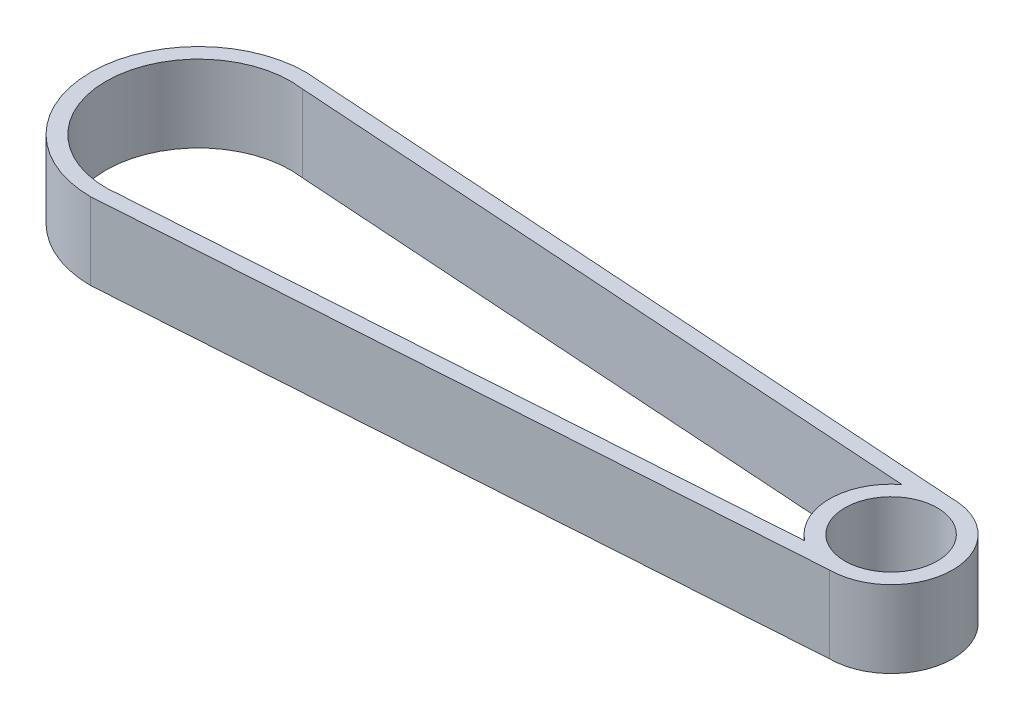
ISO-10303-21;
HEADER;
FILE_DESCRIPTION(('STEP AP214'),'2;1');
FILE_NAME('part.step','',(''),(''),'','','');
FILE_SCHEMA(('AUTOMOTIVE_DESIGN { 1 0 10303 214 1 1 1 1 }'));
ENDSEC;
DATA;
#1=APPLICATION_CONTEXT('core data for automotive mechanical design processes');
#2=APPLICATION_PROTOCOL_DEFINITION('international standard','automotive_design',2000,#1);
#3=PRODUCT_CONTEXT('',#1,'mechanical');
#4=PRODUCT('Part','Part','',(#3));
#5=PRODUCT_RELATED_PRODUCT_CATEGORY('part','',(#4));
#6=PRODUCT_DEFINITION_FORMATION('','',#4);
#7=PRODUCT_DEFINITION_CONTEXT('part definition',#1,'design');
#8=PRODUCT_DEFINITION('design','',#6,#7);
#9=PRODUCT_DEFINITION_SHAPE('','',#8);
#10=(LENGTH_UNIT() NAMED_UNIT(*) SI_UNIT(.MILLI.,.METRE.));
#11=(NAMED_UNIT(*) PLANE_ANGLE_UNIT() SI_UNIT($,.RADIAN.));
#12=(NAMED_UNIT(*) SI_UNIT($,.STERADIAN.) SOLID_ANGLE_UNIT());
#13=UNCERTAINTY_MEASURE_WITH_UNIT(LENGTH_MEASURE(1.E-05),#10,'distance_accuracy_value','');
#14=(GEOMETRIC_REPRESENTATION_CONTEXT(3) GLOBAL_UNCERTAINTY_ASSIGNED_CONTEXT((#13)) GLOBAL_UNIT_ASSIGNED_CONTEXT((#10,
#11,#12)) REPRESENTATION_CONTEXT('',''));
#15=CARTESIAN_POINT('',(0.,0.,0.));
#16=DIRECTION('',(0.,0.,1.));
#17=DIRECTION('',(1.,0.,0.));
#18=AXIS2_PLACEMENT_3D('',#15,#16,#17);
#19=CARTESIAN_POINT('',(0.,10.,0.));
#20=DIRECTION('',(0.,-1.,0.));
#21=DIRECTION('',(0.,0.,-1.));
#22=AXIS2_PLACEMENT_3D('',#19,#20,#21);
#23=CYLINDRICAL_SURFACE('',#22,14.);
#24=CARTESIAN_POINT('',(0.,0.,0.));
#25=DIRECTION('',(0.,1.,0.));
#26=DIRECTION('',(0.,0.,1.));
#27=AXIS2_PLACEMENT_3D('',#24,#25,#26);
#28=CIRCLE('',#27,14.);
#29=CARTESIAN_POINT('',(0.,0.,-14.));
#30=VERTEX_POINT('',#29);
#31=CARTESIAN_POINT('',(0.,0.,14.));
#32=VERTEX_POINT('',#31);
#33=EDGE_CURVE('E151',#30,#32,#28,.T.);
#34=ORIENTED_EDGE('',*,*,#33,.T.);
#35=DIRECTION('',(0.,-1.,0.));
#36=VECTOR('',#35,1.);
#37=CARTESIAN_POINT('',(0.,10.,14.));
#38=LINE('',#37,#36);
#39=CARTESIAN_POINT('',(0.,10.,14.));
#40=VERTEX_POINT('',#39);
#41=EDGE_CURVE('E11',#40,#32,#38,.T.);
#42=ORIENTED_EDGE('',*,*,#41,.F.);
#43=CARTESIAN_POINT('',(0.,10.,0.));
#44=DIRECTION('',(0.,1.,0.));
#45=DIRECTION('',(0.,0.,1.));
#46=AXIS2_PLACEMENT_3D('',#43,#44,#45);
#47=CIRCLE('',#46,14.);
#48=CARTESIAN_POINT('',(0.,10.,-14.));
#49=VERTEX_POINT('',#48);
#50=EDGE_CURVE('E119',#49,#40,#47,.T.);
#51=ORIENTED_EDGE('',*,*,#50,.F.);
#52=DIRECTION('',(0.,-1.,0.));
#53=VECTOR('',#52,1.);
#54=CARTESIAN_POINT('',(0.,10.,-14.));
#55=LINE('',#54,#53);
#56=EDGE_CURVE('E58',#49,#30,#55,.T.);
#57=ORIENTED_EDGE('',*,*,#56,.T.);
#58=EDGE_LOOP('',(#34,#42,#51,#57));
#59=FACE_BOUND('',#58,.T.);
#60=ADVANCED_FACE('F39',(#59),#23,.T.);
#61=CARTESIAN_POINT('',(0.929203539823009,10.,13.9380530973451));
#62=DIRECTION('',(-0.0665190105237739,0.,-0.997785157856609));
#63=DIRECTION('',(-0.997785157856609,0.,0.0665190105237739));
#64=AXIS2_PLACEMENT_3D('',#61,#62,#63);
#65=PLANE('',#64);
#66=DIRECTION('',(0.997785157856609,0.,-0.0665190105237739));
#67=VECTOR('',#66,1.);
#68=CARTESIAN_POINT('',(0.929203539823009,0.,13.9380530973451));
#69=LINE('',#68,#67);
#70=CARTESIAN_POINT('',(90.,0.,8.));
#71=VERTEX_POINT('',#70);
#72=EDGE_CURVE('E125',#32,#71,#69,.T.);
#73=ORIENTED_EDGE('',*,*,#72,.T.);
#74=DIRECTION('',(0.,-1.,0.));
#75=VECTOR('',#74,1.);
#76=CARTESIAN_POINT('',(90.,10.,8.));
#77=LINE('',#76,#75);
#78=CARTESIAN_POINT('',(90.,10.,8.));
#79=VERTEX_POINT('',#78);
#80=EDGE_CURVE('E49',#79,#71,#77,.T.);
#81=ORIENTED_EDGE('',*,*,#80,.F.);
#82=DIRECTION('',(0.997785157856609,0.,-0.0665190105237739));
#83=VECTOR('',#82,1.);
#84=CARTESIAN_POINT('',(0.929203539823009,10.,13.9380530973451));
#85=LINE('',#84,#83);
#86=EDGE_CURVE('E113',#40,#79,#85,.T.);
#87=ORIENTED_EDGE('',*,*,#86,.F.);
#88=ORIENTED_EDGE('',*,*,#41,.T.);
#89=EDGE_LOOP('',(#73,#81,#87,#88));
#90=FACE_BOUND('',#89,.T.);
#91=ADVANCED_FACE('F124',(#90),#65,.F.);
#92=CARTESIAN_POINT('',(90.,10.,0.));
#93=DIRECTION('',(0.,-1.,0.));
#94=DIRECTION('',(0.,0.,-1.));
#95=AXIS2_PLACEMENT_3D('',#92,#93,#94);
#96=CYLINDRICAL_SURFACE('',#95,8.);
#97=CARTESIAN_POINT('',(90.,0.,0.));
#98=DIRECTION('',(0.,1.,0.));
#99=DIRECTION('',(0.,0.,1.));
#100=AXIS2_PLACEMENT_3D('',#97,#98,#99);
#101=CIRCLE('',#100,8.);
#102=CARTESIAN_POINT('',(90.,0.,-8.));
#103=VERTEX_POINT('',#102);
#104=EDGE_CURVE('E154',#71,#103,#101,.T.);
#105=ORIENTED_EDGE('',*,*,#104,.T.);
#106=DIRECTION('',(0.,-1.,0.));
#107=VECTOR('',#106,1.);
#108=CARTESIAN_POINT('',(90.,10.,-8.));
#109=LINE('',#108,#107);
#110=CARTESIAN_POINT('',(90.,10.,-8.));
#111=VERTEX_POINT('',#110);
#112=EDGE_CURVE('E85',#111,#103,#109,.T.);
#113=ORIENTED_EDGE('',*,*,#112,.F.);
#114=CARTESIAN_POINT('',(90.,10.,0.));
#115=DIRECTION('',(0.,1.,0.));
#116=DIRECTION('',(0.,0.,1.));
#117=AXIS2_PLACEMENT_3D('',#114,#115,#116);
#118=CIRCLE('',#117,8.);
#119=EDGE_CURVE('E118',#79,#111,#118,.T.);
#120=ORIENTED_EDGE('',*,*,#119,.F.);
#121=ORIENTED_EDGE('',*,*,#80,.T.);
#122=EDGE_LOOP('',(#105,#113,#120,#121));
#123=FACE_BOUND('',#122,.T.);
#124=ADVANCED_FACE('F129',(#123),#96,.T.);
#125=CARTESIAN_POINT('',(0.796165518775461,10.,-11.9424827816319));
#126=DIRECTION('',(0.0665190105237739,0.,-0.997785157856609));
#127=DIRECTION('',(-0.997785157856609,0.,-0.0665190105237739));
#128=AXIS2_PLACEMENT_3D('',#125,#126,#127);
#129=PLANE('',#128);
#130=DIRECTION('',(0.997785157856609,0.,0.0665190105237739));
#131=VECTOR('',#130,1.);
#132=CARTESIAN_POINT('',(0.796165518775461,0.,-11.9424827816319));
#133=LINE('',#132,#131);
#134=CARTESIAN_POINT('',(1.65636135045122,0.,-11.8851363928535));
#135=VERTEX_POINT('',#134);
#136=CARTESIAN_POINT('',(85.0981733924065,0.,-6.32234892338984));
#137=VERTEX_POINT('',#136);
#138=EDGE_CURVE('E139',#135,#137,#133,.T.);
#139=ORIENTED_EDGE('',*,*,#138,.T.);
#140=DIRECTION('',(0.,-1.,0.));
#141=VECTOR('',#140,1.);
#142=CARTESIAN_POINT('',(85.0981733924065,10.,-6.32234892338984));
#143=LINE('',#142,#141);
#144=CARTESIAN_POINT('',(85.0981733924065,10.,-6.32234892338984));
#145=VERTEX_POINT('',#144);
#146=EDGE_CURVE('E43',#145,#137,#143,.T.);
#147=ORIENTED_EDGE('',*,*,#146,.F.);
#148=DIRECTION('',(0.997785157856609,0.,0.0665190105237739));
#149=VECTOR('',#148,1.);
#150=CARTESIAN_POINT('',(0.796165518775461,10.,-11.9424827816319));
#151=LINE('',#150,#149);
#152=CARTESIAN_POINT('',(1.65636135045122,10.,-11.8851363928535));
#153=VERTEX_POINT('',#152);
#154=EDGE_CURVE('E215',#153,#145,#151,.T.);
#155=ORIENTED_EDGE('',*,*,#154,.F.);
#156=DIRECTION('',(0.,-1.,0.));
#157=VECTOR('',#156,1.);
#158=CARTESIAN_POINT('',(1.65636135045122,10.,-11.8851363928535));
#159=LINE('',#158,#157);
#160=EDGE_CURVE('E132',#153,#135,#159,.T.);
#161=ORIENTED_EDGE('',*,*,#160,.T.);
#162=EDGE_LOOP('',(#139,#147,#155,#161));
#163=FACE_BOUND('',#162,.T.);
#164=ADVANCED_FACE('F173',(#163),#129,.F.);
#165=CARTESIAN_POINT('',(90.,10.,0.));
#166=DIRECTION('',(0.,-1.,0.));
#167=DIRECTION('',(0.,0.,-1.));
#168=AXIS2_PLACEMENT_3D('',#165,#166,#167);
#169=CYLINDRICAL_SURFACE('',#168,8.);
#170=CARTESIAN_POINT('',(90.,0.,0.));
#171=DIRECTION('',(0.,1.,0.));
#172=DIRECTION('',(0.,0.,1.));
#173=AXIS2_PLACEMENT_3D('',#170,#171,#172);
#174=CIRCLE('',#173,8.);
#175=CARTESIAN_POINT('',(85.0981733924065,0.,6.32234892338984));
#176=VERTEX_POINT('',#175);
#177=EDGE_CURVE('E142',#137,#176,#174,.T.);
#178=ORIENTED_EDGE('',*,*,#177,.T.);
#179=DIRECTION('',(0.,-1.,0.));
#180=VECTOR('',#179,1.);
#181=CARTESIAN_POINT('',(85.0981733924065,10.,6.32234892338984));
#182=LINE('',#181,#180);
#183=CARTESIAN_POINT('',(85.0981733924065,10.,6.32234892338984));
#184=VERTEX_POINT('',#183);
#185=EDGE_CURVE('E164',#184,#176,#182,.T.);
#186=ORIENTED_EDGE('',*,*,#185,.F.);
#187=CARTESIAN_POINT('',(90.,10.,0.));
#188=DIRECTION('',(0.,1.,0.));
#189=DIRECTION('',(0.,0.,1.));
#190=AXIS2_PLACEMENT_3D('',#187,#188,#189);
#191=CIRCLE('',#190,8.);
#192=EDGE_CURVE('E98',#145,#184,#191,.T.);
#193=ORIENTED_EDGE('',*,*,#192,.F.);
#194=ORIENTED_EDGE('',*,*,#146,.T.);
#195=EDGE_LOOP('',(#178,#186,#193,#194));
#196=FACE_BOUND('',#195,.T.);
#197=ADVANCED_FACE('F169',(#196),#169,.T.);
#198=CARTESIAN_POINT('',(0.796165518775461,10.,11.9424827816319));
#199=DIRECTION('',(-0.0665190105237739,0.,-0.997785157856609));
#200=DIRECTION('',(-0.997785157856609,0.,0.0665190105237739));
#201=AXIS2_PLACEMENT_3D('',#198,#199,#200);
#202=PLANE('',#201);
#203=DIRECTION('',(0.997785157856609,0.,-0.0665190105237739));
#204=VECTOR('',#203,1.);
#205=CARTESIAN_POINT('',(0.796165518775461,0.,11.9424827816319));
#206=LINE('',#205,#204);
#207=CARTESIAN_POINT('',(1.65636135045121,0.,11.8851363928535));
#208=VERTEX_POINT('',#207);
#209=EDGE_CURVE('E145',#208,#176,#206,.T.);
#210=ORIENTED_EDGE('',*,*,#209,.F.);
#211=DIRECTION('',(0.,-1.,0.));
#212=VECTOR('',#211,1.);
#213=CARTESIAN_POINT('',(1.65636135045121,10.,11.8851363928535));
#214=LINE('',#213,#212);
#215=CARTESIAN_POINT('',(1.65636135045121,10.,11.8851363928535));
#216=VERTEX_POINT('',#215);
#217=EDGE_CURVE('E163',#216,#208,#214,.T.);
#218=ORIENTED_EDGE('',*,*,#217,.F.);
#219=DIRECTION('',(0.997785157856609,0.,-0.0665190105237739));
#220=VECTOR('',#219,1.);
#221=CARTESIAN_POINT('',(0.796165518775461,10.,11.9424827816319));
#222=LINE('',#221,#220);
#223=EDGE_CURVE('E217',#216,#184,#222,.T.);
#224=ORIENTED_EDGE('',*,*,#223,.T.);
#225=ORIENTED_EDGE('',*,*,#185,.T.);
#226=EDGE_LOOP('',(#210,#218,#224,#225));
#227=FACE_BOUND('',#226,.T.);
#228=ADVANCED_FACE('F184',(#227),#202,.T.);
#229=CARTESIAN_POINT('',(0.,10.,0.));
#230=DIRECTION('',(0.,-1.,0.));
#231=DIRECTION('',(0.,0.,-1.));
#232=AXIS2_PLACEMENT_3D('',#229,#230,#231);
#233=CYLINDRICAL_SURFACE('',#232,12.);
#234=CARTESIAN_POINT('',(0.,0.,0.));
#235=DIRECTION('',(0.,1.,0.));
#236=DIRECTION('',(0.,0.,1.));
#237=AXIS2_PLACEMENT_3D('',#234,#235,#236);
#238=CIRCLE('',#237,12.);
#239=EDGE_CURVE('E148',#135,#208,#238,.T.);
#240=ORIENTED_EDGE('',*,*,#239,.F.);
#241=ORIENTED_EDGE('',*,*,#160,.F.);
#242=CARTESIAN_POINT('',(0.,10.,0.));
#243=DIRECTION('',(0.,1.,0.));
#244=DIRECTION('',(0.,0.,1.));
#245=AXIS2_PLACEMENT_3D('',#242,#243,#244);
#246=CIRCLE('',#245,12.);
#247=EDGE_CURVE('E182',#153,#216,#246,.T.);
#248=ORIENTED_EDGE('',*,*,#247,.T.);
#249=ORIENTED_EDGE('',*,*,#217,.T.);
#250=EDGE_LOOP('',(#240,#241,#248,#249));
#251=FACE_BOUND('',#250,.T.);
#252=ADVANCED_FACE('F179',(#251),#233,.F.);
#253=CARTESIAN_POINT('',(90.,10.,0.));
#254=DIRECTION('',(0.,-1.,0.));
#255=DIRECTION('',(0.,0.,-1.));
#256=AXIS2_PLACEMENT_3D('',#253,#254,#255);
#257=CYLINDRICAL_SURFACE('',#256,5.99999999999999);
#258=CARTESIAN_POINT('',(90.,10.,0.));
#259=DIRECTION('',(0.,1.,0.));
#260=DIRECTION('',(0.,0.,1.));
#261=AXIS2_PLACEMENT_3D('',#258,#259,#260);
#262=CIRCLE('',#261,5.99999999999999);
#263=CARTESIAN_POINT('',(90.,10.,5.99999999999999));
#264=VERTEX_POINT('',#263);
#265=EDGE_CURVE('E159',#264,#264,#262,.T.);
#266=ORIENTED_EDGE('',*,*,#265,.T.);
#267=EDGE_LOOP('',(#266));
#268=FACE_BOUND('',#267,.T.);
#269=CARTESIAN_POINT('',(90.,0.,0.));
#270=DIRECTION('',(0.,1.,0.));
#271=DIRECTION('',(0.,0.,1.));
#272=AXIS2_PLACEMENT_3D('',#269,#270,#271);
#273=CIRCLE('',#272,5.99999999999999);
#274=CARTESIAN_POINT('',(90.,0.,5.99999999999999));
#275=VERTEX_POINT('',#274);
#276=EDGE_CURVE('E136',#275,#275,#273,.T.);
#277=ORIENTED_EDGE('',*,*,#276,.F.);
#278=EDGE_LOOP('',(#277));
#279=FACE_BOUND('',#278,.T.);
#280=ADVANCED_FACE('F41',(#268,#279),#257,.F.);
#281=CARTESIAN_POINT('',(0.929203539823009,10.,-13.9380530973451));
#282=DIRECTION('',(0.0665190105237739,0.,-0.997785157856609));
#283=DIRECTION('',(-0.997785157856609,0.,-0.0665190105237739));
#284=AXIS2_PLACEMENT_3D('',#281,#282,#283);
#285=PLANE('',#284);
#286=DIRECTION('',(0.997785157856609,0.,0.0665190105237739));
#287=VECTOR('',#286,1.);
#288=CARTESIAN_POINT('',(0.929203539823009,0.,-13.9380530973451));
#289=LINE('',#288,#287);
#290=EDGE_CURVE('E156',#30,#103,#289,.T.);
#291=ORIENTED_EDGE('',*,*,#290,.F.);
#292=ORIENTED_EDGE('',*,*,#56,.F.);
#293=DIRECTION('',(0.997785157856609,0.,0.0665190105237739));
#294=VECTOR('',#293,1.);
#295=CARTESIAN_POINT('',(0.929203539823009,10.,-13.9380530973451));
#296=LINE('',#295,#294);
#297=EDGE_CURVE('E130',#49,#111,#296,.T.);
#298=ORIENTED_EDGE('',*,*,#297,.T.);
#299=ORIENTED_EDGE('',*,*,#112,.T.);
#300=EDGE_LOOP('',(#291,#292,#298,#299));
#301=FACE_BOUND('',#300,.T.);
#302=ADVANCED_FACE('F202',(#301),#285,.T.);
#303=CARTESIAN_POINT('',(0.,10.,0.));
#304=DIRECTION('',(0.,1.,0.));
#305=DIRECTION('',(0.,0.,1.));
#306=AXIS2_PLACEMENT_3D('',#303,#304,#305);
#307=PLANE('',#306);
#308=ORIENTED_EDGE('',*,*,#265,.F.);
#309=EDGE_LOOP('',(#308));
#310=FACE_BOUND('',#309,.T.);
#311=ORIENTED_EDGE('',*,*,#154,.T.);
#312=ORIENTED_EDGE('',*,*,#192,.T.);
#313=ORIENTED_EDGE('',*,*,#223,.F.);
#314=ORIENTED_EDGE('',*,*,#247,.F.);
#315=EDGE_LOOP('',(#311,#312,#313,#314));
#316=FACE_BOUND('',#315,.T.);
#317=ORIENTED_EDGE('',*,*,#50,.T.);
#318=ORIENTED_EDGE('',*,*,#86,.T.);
#319=ORIENTED_EDGE('',*,*,#119,.T.);
#320=ORIENTED_EDGE('',*,*,#297,.F.);
#321=EDGE_LOOP('',(#317,#318,#319,#320));
#322=FACE_BOUND('',#321,.T.);
#323=ADVANCED_FACE('F115',(#310,#316,#322),#307,.T.);
#324=CARTESIAN_POINT('',(0.,0.,0.));
#325=DIRECTION('',(0.,1.,0.));
#326=DIRECTION('',(0.,0.,1.));
#327=AXIS2_PLACEMENT_3D('',#324,#325,#326);
#328=PLANE('',#327);
#329=ORIENTED_EDGE('',*,*,#276,.T.);
#330=EDGE_LOOP('',(#329));
#331=FACE_BOUND('',#330,.T.);
#332=ORIENTED_EDGE('',*,*,#138,.F.);
#333=ORIENTED_EDGE('',*,*,#239,.T.);
#334=ORIENTED_EDGE('',*,*,#209,.T.);
#335=ORIENTED_EDGE('',*,*,#177,.F.);
#336=EDGE_LOOP('',(#332,#333,#334,#335));
#337=FACE_BOUND('',#336,.T.);
#338=ORIENTED_EDGE('',*,*,#33,.F.);
#339=ORIENTED_EDGE('',*,*,#290,.T.);
#340=ORIENTED_EDGE('',*,*,#104,.F.);
#341=ORIENTED_EDGE('',*,*,#72,.F.);
#342=EDGE_LOOP('',(#338,#339,#340,#341));
#343=FACE_BOUND('',#342,.T.);
#344=ADVANCED_FACE('F176',(#331,#337,#343),#328,.F.);
#345=CLOSED_SHELL('',(#60,#91,#124,#164,#197,#228,#252,#280,#302,#323,#344));
#346=MANIFOLD_SOLID_BREP('B2',#345);
#347=ADVANCED_BREP_SHAPE_REPRESENTATION('',(#18,#346),#14);
#348=SHAPE_DEFINITION_REPRESENTATION(#9,#347);
ENDSEC;
END-ISO-10303-21;
